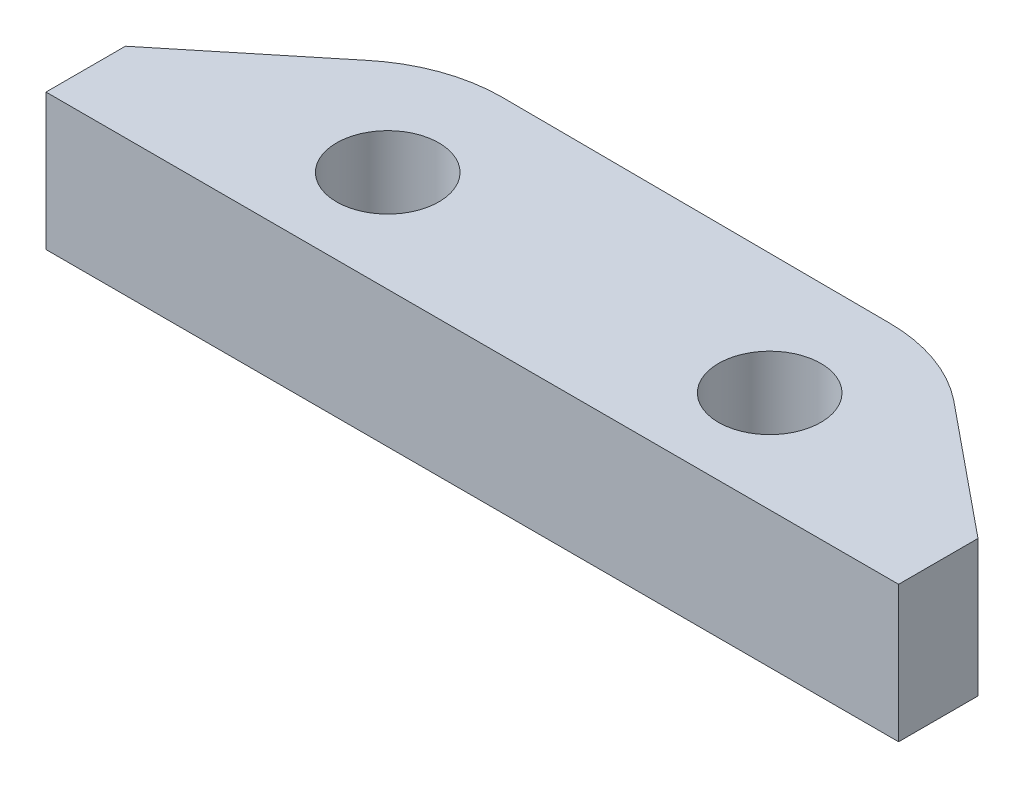
ISO-10303-21;
HEADER;
FILE_DESCRIPTION(('STEP AP214'),'2;1');
FILE_NAME('part.step','',(''),(''),'','','');
FILE_SCHEMA(('AUTOMOTIVE_DESIGN { 1 0 10303 214 1 1 1 1 }'));
ENDSEC;
DATA;
#1=APPLICATION_CONTEXT('core data for automotive mechanical design processes');
#2=APPLICATION_PROTOCOL_DEFINITION('international standard','automotive_design',2000,#1);
#3=PRODUCT_CONTEXT('',#1,'mechanical');
#4=PRODUCT('Part','Part','',(#3));
#5=PRODUCT_RELATED_PRODUCT_CATEGORY('part','',(#4));
#6=PRODUCT_DEFINITION_FORMATION('','',#4);
#7=PRODUCT_DEFINITION_CONTEXT('part definition',#1,'design');
#8=PRODUCT_DEFINITION('design','',#6,#7);
#9=PRODUCT_DEFINITION_SHAPE('','',#8);
#10=(LENGTH_UNIT() NAMED_UNIT(*) SI_UNIT(.MILLI.,.METRE.));
#11=(NAMED_UNIT(*) PLANE_ANGLE_UNIT() SI_UNIT($,.RADIAN.));
#12=(NAMED_UNIT(*) SI_UNIT($,.STERADIAN.) SOLID_ANGLE_UNIT());
#13=UNCERTAINTY_MEASURE_WITH_UNIT(LENGTH_MEASURE(1.E-05),#10,'distance_accuracy_value','');
#14=(GEOMETRIC_REPRESENTATION_CONTEXT(3) GLOBAL_UNCERTAINTY_ASSIGNED_CONTEXT((#13)) GLOBAL_UNIT_ASSIGNED_CONTEXT((#10,
#11,#12)) REPRESENTATION_CONTEXT('',''));
#15=CARTESIAN_POINT('',(0.,0.,0.));
#16=DIRECTION('',(0.,0.,1.));
#17=DIRECTION('',(1.,0.,0.));
#18=AXIS2_PLACEMENT_3D('',#15,#16,#17);
#19=CARTESIAN_POINT('',(-5.68742435642213,4.,1.63906488024816));
#20=DIRECTION('',(0.,1.,0.));
#21=DIRECTION('',(0.,0.,1.));
#22=AXIS2_PLACEMENT_3D('',#19,#20,#21);
#23=PLANE('',#22);
#24=CARTESIAN_POINT('',(-5.44999815077826,4.,0.648590638947355));
#25=DIRECTION('',(0.,1.,0.));
#26=DIRECTION('',(0.,0.,1.));
#27=AXIS2_PLACEMENT_3D('',#24,#25,#26);
#28=CIRCLE('',#27,1.4999999847998);
#29=CARTESIAN_POINT('',(-5.44999815077826,4.,2.14859062374715));
#30=VERTEX_POINT('',#29);
#31=EDGE_CURVE('E146',#30,#30,#28,.T.);
#32=ORIENTED_EDGE('',*,*,#31,.F.);
#33=EDGE_LOOP('',(#32));
#34=FACE_BOUND('',#33,.T.);
#35=DIRECTION('',(-0.774870809072475,0.,0.632119632069253));
#36=VECTOR('',#35,1.);
#37=CARTESIAN_POINT('',(-12.4999979775757,4.,1.29042892201448));
#38=LINE('',#37,#36);
#39=CARTESIAN_POINT('',(-8.6279017925265,4.,-1.86832733408952));
#40=VERTEX_POINT('',#39);
#41=CARTESIAN_POINT('',(-12.4999979775757,4.,1.29042892201448));
#42=VERTEX_POINT('',#41);
#43=EDGE_CURVE('E164',#40,#42,#38,.T.);
#44=ORIENTED_EDGE('',*,*,#43,.T.);
#45=DIRECTION('',(0.,0.,1.));
#46=VECTOR('',#45,1.);
#47=CARTESIAN_POINT('',(-12.4999979775757,4.,1.29042892201448));
#48=LINE('',#47,#46);
#49=CARTESIAN_POINT('',(-12.4999979775757,4.,3.61859063847739));
#50=VERTEX_POINT('',#49);
#51=EDGE_CURVE('E100',#42,#50,#48,.T.);
#52=ORIENTED_EDGE('',*,*,#51,.T.);
#53=DIRECTION('',(1.,0.,0.));
#54=VECTOR('',#53,1.);
#55=CARTESIAN_POINT('',(-12.4999979775757,4.,3.61859063847739));
#56=LINE('',#55,#54);
#57=CARTESIAN_POINT('',(12.5000009536745,4.,3.61859063847739));
#58=VERTEX_POINT('',#57);
#59=EDGE_CURVE('E185',#50,#58,#56,.T.);
#60=ORIENTED_EDGE('',*,*,#59,.T.);
#61=DIRECTION('',(0.,0.,-1.));
#62=VECTOR('',#61,1.);
#63=CARTESIAN_POINT('',(12.5000009536745,4.,3.61859063847739));
#64=LINE('',#63,#62);
#65=CARTESIAN_POINT('',(12.5000009536745,4.,1.29042892201448));
#66=VERTEX_POINT('',#65);
#67=EDGE_CURVE('E199',#58,#66,#64,.T.);
#68=ORIENTED_EDGE('',*,*,#67,.T.);
#69=DIRECTION('',(-0.774870722952468,0.,-0.632119737637673));
#70=VECTOR('',#69,1.);
#71=CARTESIAN_POINT('',(12.5000009536745,4.,1.29042892201448));
#72=LINE('',#71,#70);
#73=CARTESIAN_POINT('',(8.6279058456415,4.,-1.86832733408952));
#74=VERTEX_POINT('',#73);
#75=EDGE_CURVE('E119',#66,#74,#72,.T.);
#76=ORIENTED_EDGE('',*,*,#75,.T.);
#77=CARTESIAN_POINT('',(5.71991749015979,4.,1.79674585860179));
#78=DIRECTION('',(0.,1.,0.));
#79=DIRECTION('',(0.,0.,1.));
#80=AXIS2_PLACEMENT_3D('',#77,#78,#79);
#81=CIRCLE('',#80,4.67858501936233);
#82=CARTESIAN_POINT('',(5.71991749015979,4.,-2.88183916076055));
#83=VERTEX_POINT('',#82);
#84=EDGE_CURVE('E113',#74,#83,#81,.T.);
#85=ORIENTED_EDGE('',*,*,#84,.T.);
#86=DIRECTION('',(-0.999987943106075,0.,-0.00491056437499346));
#87=VECTOR('',#86,1.);
#88=CARTESIAN_POINT('',(5.71991749015979,4.,-2.88183916076054));
#89=LINE('',#88,#87);
#90=CARTESIAN_POINT('',(-5.68742435642213,4.,-2.93785632263872));
#91=VERTEX_POINT('',#90);
#92=EDGE_CURVE('E117',#83,#91,#89,.T.);
#93=ORIENTED_EDGE('',*,*,#92,.T.);
#94=CARTESIAN_POINT('',(-5.68742435642213,4.,1.63906488024816));
#95=DIRECTION('',(0.,1.,0.));
#96=DIRECTION('',(0.,0.,1.));
#97=AXIS2_PLACEMENT_3D('',#94,#95,#96);
#98=CIRCLE('',#97,4.57692120288688);
#99=EDGE_CURVE('E57',#91,#40,#98,.T.);
#100=ORIENTED_EDGE('',*,*,#99,.T.);
#101=EDGE_LOOP('',(#44,#52,#60,#68,#76,#85,#93,#100));
#102=FACE_BOUND('',#101,.T.);
#103=CARTESIAN_POINT('',(5.75000108306335,4.,0.648590609865482));
#104=DIRECTION('',(0.,1.,0.));
#105=DIRECTION('',(0.,0.,1.));
#106=AXIS2_PLACEMENT_3D('',#103,#104,#105);
#107=CIRCLE('',#106,1.49999987061116);
#108=CARTESIAN_POINT('',(5.75000108306335,4.,2.14859048047664));
#109=VERTEX_POINT('',#108);
#110=EDGE_CURVE('E213',#109,#109,#107,.T.);
#111=ORIENTED_EDGE('',*,*,#110,.F.);
#112=EDGE_LOOP('',(#111));
#113=FACE_BOUND('',#112,.T.);
#114=ADVANCED_FACE('F39',(#34,#102,#113),#23,.T.);
#115=CARTESIAN_POINT('',(-5.68742435642213,0.,1.63906488024816));
#116=DIRECTION('',(0.,1.,0.));
#117=DIRECTION('',(0.,0.,1.));
#118=AXIS2_PLACEMENT_3D('',#115,#116,#117);
#119=PLANE('',#118);
#120=DIRECTION('',(-0.774870809072475,0.,0.632119632069253));
#121=VECTOR('',#120,1.);
#122=CARTESIAN_POINT('',(-12.4999979775757,0.,1.29042892201448));
#123=LINE('',#122,#121);
#124=CARTESIAN_POINT('',(-8.6279017925265,0.,-1.86832733408952));
#125=VERTEX_POINT('',#124);
#126=CARTESIAN_POINT('',(-12.4999979775757,0.,1.29042892201448));
#127=VERTEX_POINT('',#126);
#128=EDGE_CURVE('E141',#125,#127,#123,.T.);
#129=ORIENTED_EDGE('',*,*,#128,.F.);
#130=CARTESIAN_POINT('',(-5.68742435642213,0.,1.63906488024816));
#131=DIRECTION('',(0.,1.,0.));
#132=DIRECTION('',(0.,0.,1.));
#133=AXIS2_PLACEMENT_3D('',#130,#131,#132);
#134=CIRCLE('',#133,4.57692120288688);
#135=CARTESIAN_POINT('',(-5.68742435642213,0.,-2.93785632263872));
#136=VERTEX_POINT('',#135);
#137=EDGE_CURVE('E92',#136,#125,#134,.T.);
#138=ORIENTED_EDGE('',*,*,#137,.F.);
#139=DIRECTION('',(-0.999987943106075,0.,-0.00491056437499346));
#140=VECTOR('',#139,1.);
#141=CARTESIAN_POINT('',(5.71991749015979,0.,-2.88183916076054));
#142=LINE('',#141,#140);
#143=CARTESIAN_POINT('',(5.71991749015979,0.,-2.88183916076055));
#144=VERTEX_POINT('',#143);
#145=EDGE_CURVE('E86',#144,#136,#142,.T.);
#146=ORIENTED_EDGE('',*,*,#145,.F.);
#147=CARTESIAN_POINT('',(5.71991749015979,0.,1.79674585860179));
#148=DIRECTION('',(0.,1.,0.));
#149=DIRECTION('',(0.,0.,1.));
#150=AXIS2_PLACEMENT_3D('',#147,#148,#149);
#151=CIRCLE('',#150,4.67858501936233);
#152=CARTESIAN_POINT('',(8.6279058456415,0.,-1.86832733408952));
#153=VERTEX_POINT('',#152);
#154=EDGE_CURVE('E128',#153,#144,#151,.T.);
#155=ORIENTED_EDGE('',*,*,#154,.F.);
#156=DIRECTION('',(-0.774870722952468,0.,-0.632119737637673));
#157=VECTOR('',#156,1.);
#158=CARTESIAN_POINT('',(12.5000009536745,0.,1.29042892201448));
#159=LINE('',#158,#157);
#160=CARTESIAN_POINT('',(12.5000009536745,0.,1.29042892201448));
#161=VERTEX_POINT('',#160);
#162=EDGE_CURVE('E155',#161,#153,#159,.T.);
#163=ORIENTED_EDGE('',*,*,#162,.F.);
#164=DIRECTION('',(0.,0.,-1.));
#165=VECTOR('',#164,1.);
#166=CARTESIAN_POINT('',(12.5000009536745,0.,3.61859063847739));
#167=LINE('',#166,#165);
#168=CARTESIAN_POINT('',(12.5000009536745,0.,3.61859063847739));
#169=VERTEX_POINT('',#168);
#170=EDGE_CURVE('E152',#169,#161,#167,.T.);
#171=ORIENTED_EDGE('',*,*,#170,.F.);
#172=DIRECTION('',(1.,0.,0.));
#173=VECTOR('',#172,1.);
#174=CARTESIAN_POINT('',(-12.4999979775757,0.,3.61859063847739));
#175=LINE('',#174,#173);
#176=CARTESIAN_POINT('',(-12.4999979775757,0.,3.61859063847739));
#177=VERTEX_POINT('',#176);
#178=EDGE_CURVE('E149',#177,#169,#175,.T.);
#179=ORIENTED_EDGE('',*,*,#178,.F.);
#180=DIRECTION('',(0.,0.,1.));
#181=VECTOR('',#180,1.);
#182=CARTESIAN_POINT('',(-12.4999979775757,0.,1.29042892201448));
#183=LINE('',#182,#181);
#184=EDGE_CURVE('E145',#127,#177,#183,.T.);
#185=ORIENTED_EDGE('',*,*,#184,.F.);
#186=EDGE_LOOP('',(#129,#138,#146,#155,#163,#171,#179,#185));
#187=FACE_BOUND('',#186,.T.);
#188=CARTESIAN_POINT('',(-5.44999815077826,0.,0.648590638947355));
#189=DIRECTION('',(0.,1.,0.));
#190=DIRECTION('',(0.,0.,1.));
#191=AXIS2_PLACEMENT_3D('',#188,#189,#190);
#192=CIRCLE('',#191,1.4999999847998);
#193=CARTESIAN_POINT('',(-5.44999815077826,0.,2.14859062374715));
#194=VERTEX_POINT('',#193);
#195=EDGE_CURVE('E209',#194,#194,#192,.T.);
#196=ORIENTED_EDGE('',*,*,#195,.T.);
#197=EDGE_LOOP('',(#196));
#198=FACE_BOUND('',#197,.T.);
#199=CARTESIAN_POINT('',(5.75000108306335,0.,0.648590609865482));
#200=DIRECTION('',(0.,1.,0.));
#201=DIRECTION('',(0.,0.,1.));
#202=AXIS2_PLACEMENT_3D('',#199,#200,#201);
#203=CIRCLE('',#202,1.49999987061116);
#204=CARTESIAN_POINT('',(5.75000108306335,0.,2.14859048047664));
#205=VERTEX_POINT('',#204);
#206=EDGE_CURVE('E217',#205,#205,#203,.T.);
#207=ORIENTED_EDGE('',*,*,#206,.T.);
#208=EDGE_LOOP('',(#207));
#209=FACE_BOUND('',#208,.T.);
#210=ADVANCED_FACE('F189',(#187,#198,#209),#119,.F.);
#211=CARTESIAN_POINT('',(-12.4999979775757,4.,1.29042892201448));
#212=DIRECTION('',(0.632119632069253,0.,0.774870809072475));
#213=DIRECTION('',(0.774870809072475,0.,-0.632119632069253));
#214=AXIS2_PLACEMENT_3D('',#211,#212,#213);
#215=PLANE('',#214);
#216=ORIENTED_EDGE('',*,*,#128,.T.);
#217=DIRECTION('',(0.,-1.,0.));
#218=VECTOR('',#217,1.);
#219=CARTESIAN_POINT('',(-12.4999979775757,4.,1.29042892201448));
#220=LINE('',#219,#218);
#221=EDGE_CURVE('E11',#42,#127,#220,.T.);
#222=ORIENTED_EDGE('',*,*,#221,.F.);
#223=ORIENTED_EDGE('',*,*,#43,.F.);
#224=DIRECTION('',(0.,-1.,0.));
#225=VECTOR('',#224,1.);
#226=CARTESIAN_POINT('',(-8.6279017925265,4.,-1.86832733408952));
#227=LINE('',#226,#225);
#228=EDGE_CURVE('E137',#40,#125,#227,.T.);
#229=ORIENTED_EDGE('',*,*,#228,.T.);
#230=EDGE_LOOP('',(#216,#222,#223,#229));
#231=FACE_BOUND('',#230,.T.);
#232=ADVANCED_FACE('F41',(#231),#215,.F.);
#233=CARTESIAN_POINT('',(-12.4999979775757,4.,1.29042892201448));
#234=DIRECTION('',(1.,0.,0.));
#235=DIRECTION('',(0.,0.,-1.));
#236=AXIS2_PLACEMENT_3D('',#233,#234,#235);
#237=PLANE('',#236);
#238=ORIENTED_EDGE('',*,*,#184,.T.);
#239=DIRECTION('',(0.,-1.,0.));
#240=VECTOR('',#239,1.);
#241=CARTESIAN_POINT('',(-12.4999979775757,4.,3.61859063847739));
#242=LINE('',#241,#240);
#243=EDGE_CURVE('E49',#50,#177,#242,.T.);
#244=ORIENTED_EDGE('',*,*,#243,.F.);
#245=ORIENTED_EDGE('',*,*,#51,.F.);
#246=ORIENTED_EDGE('',*,*,#221,.T.);
#247=EDGE_LOOP('',(#238,#244,#245,#246));
#248=FACE_BOUND('',#247,.T.);
#249=ADVANCED_FACE('F251',(#248),#237,.F.);
#250=CARTESIAN_POINT('',(-12.4999979775757,4.,3.61859063847739));
#251=DIRECTION('',(0.,0.,-1.));
#252=DIRECTION('',(-1.,0.,0.));
#253=AXIS2_PLACEMENT_3D('',#250,#251,#252);
#254=PLANE('',#253);
#255=ORIENTED_EDGE('',*,*,#178,.T.);
#256=DIRECTION('',(0.,-1.,0.));
#257=VECTOR('',#256,1.);
#258=CARTESIAN_POINT('',(12.5000009536745,4.,3.61859063847739));
#259=LINE('',#258,#257);
#260=EDGE_CURVE('E175',#58,#169,#259,.T.);
#261=ORIENTED_EDGE('',*,*,#260,.F.);
#262=ORIENTED_EDGE('',*,*,#59,.F.);
#263=ORIENTED_EDGE('',*,*,#243,.T.);
#264=EDGE_LOOP('',(#255,#261,#262,#263));
#265=FACE_BOUND('',#264,.T.);
#266=ADVANCED_FACE('F183',(#265),#254,.F.);
#267=CARTESIAN_POINT('',(12.5000009536745,4.,3.61859063847739));
#268=DIRECTION('',(-1.,0.,0.));
#269=DIRECTION('',(0.,0.,1.));
#270=AXIS2_PLACEMENT_3D('',#267,#268,#269);
#271=PLANE('',#270);
#272=ORIENTED_EDGE('',*,*,#170,.T.);
#273=DIRECTION('',(0.,-1.,0.));
#274=VECTOR('',#273,1.);
#275=CARTESIAN_POINT('',(12.5000009536745,4.,1.29042892201448));
#276=LINE('',#275,#274);
#277=EDGE_CURVE('E171',#66,#161,#276,.T.);
#278=ORIENTED_EDGE('',*,*,#277,.F.);
#279=ORIENTED_EDGE('',*,*,#67,.F.);
#280=ORIENTED_EDGE('',*,*,#260,.T.);
#281=EDGE_LOOP('',(#272,#278,#279,#280));
#282=FACE_BOUND('',#281,.T.);
#283=ADVANCED_FACE('F194',(#282),#271,.F.);
#284=CARTESIAN_POINT('',(12.5000009536745,4.,1.29042892201448));
#285=DIRECTION('',(-0.632119737637673,0.,0.774870722952468));
#286=DIRECTION('',(0.774870722952468,0.,0.632119737637673));
#287=AXIS2_PLACEMENT_3D('',#284,#285,#286);
#288=PLANE('',#287);
#289=ORIENTED_EDGE('',*,*,#162,.T.);
#290=DIRECTION('',(0.,-1.,0.));
#291=VECTOR('',#290,1.);
#292=CARTESIAN_POINT('',(8.6279058456415,4.,-1.86832733408952));
#293=LINE('',#292,#291);
#294=EDGE_CURVE('E130',#74,#153,#293,.T.);
#295=ORIENTED_EDGE('',*,*,#294,.F.);
#296=ORIENTED_EDGE('',*,*,#75,.F.);
#297=ORIENTED_EDGE('',*,*,#277,.T.);
#298=EDGE_LOOP('',(#289,#295,#296,#297));
#299=FACE_BOUND('',#298,.T.);
#300=ADVANCED_FACE('F197',(#299),#288,.F.);
#301=CARTESIAN_POINT('',(5.71991749015979,4.,1.79674585860179));
#302=DIRECTION('',(0.,-1.,0.));
#303=DIRECTION('',(0.,0.,-1.));
#304=AXIS2_PLACEMENT_3D('',#301,#302,#303);
#305=CYLINDRICAL_SURFACE('',#304,4.67858501936233);
#306=ORIENTED_EDGE('',*,*,#154,.T.);
#307=DIRECTION('',(0.,-1.,0.));
#308=VECTOR('',#307,1.);
#309=CARTESIAN_POINT('',(5.71991749015979,4.,-2.88183916076055));
#310=LINE('',#309,#308);
#311=EDGE_CURVE('E125',#83,#144,#310,.T.);
#312=ORIENTED_EDGE('',*,*,#311,.F.);
#313=ORIENTED_EDGE('',*,*,#84,.F.);
#314=ORIENTED_EDGE('',*,*,#294,.T.);
#315=EDGE_LOOP('',(#306,#312,#313,#314));
#316=FACE_BOUND('',#315,.T.);
#317=ADVANCED_FACE('F126',(#316),#305,.T.);
#318=CARTESIAN_POINT('',(5.71991749015979,4.,-2.88183916076054));
#319=DIRECTION('',(-0.00491056437499346,0.,0.999987943106075));
#320=DIRECTION('',(0.999987943106075,0.,0.00491056437499346));
#321=AXIS2_PLACEMENT_3D('',#318,#319,#320);
#322=PLANE('',#321);
#323=ORIENTED_EDGE('',*,*,#145,.T.);
#324=DIRECTION('',(0.,-1.,0.));
#325=VECTOR('',#324,1.);
#326=CARTESIAN_POINT('',(-5.68742435642213,4.,-2.93785632263872));
#327=LINE('',#326,#325);
#328=EDGE_CURVE('E131',#91,#136,#327,.T.);
#329=ORIENTED_EDGE('',*,*,#328,.F.);
#330=ORIENTED_EDGE('',*,*,#92,.F.);
#331=ORIENTED_EDGE('',*,*,#311,.T.);
#332=EDGE_LOOP('',(#323,#329,#330,#331));
#333=FACE_BOUND('',#332,.T.);
#334=ADVANCED_FACE('F133',(#333),#322,.F.);
#335=CARTESIAN_POINT('',(-5.68742435642213,4.,1.63906488024816));
#336=DIRECTION('',(0.,-1.,0.));
#337=DIRECTION('',(0.,0.,-1.));
#338=AXIS2_PLACEMENT_3D('',#335,#336,#337);
#339=CYLINDRICAL_SURFACE('',#338,4.57692120288688);
#340=ORIENTED_EDGE('',*,*,#137,.T.);
#341=ORIENTED_EDGE('',*,*,#228,.F.);
#342=ORIENTED_EDGE('',*,*,#99,.F.);
#343=ORIENTED_EDGE('',*,*,#328,.T.);
#344=EDGE_LOOP('',(#340,#341,#342,#343));
#345=FACE_BOUND('',#344,.T.);
#346=ADVANCED_FACE('F239',(#345),#339,.T.);
#347=CARTESIAN_POINT('',(-5.44999815077826,4.,0.648590638947355));
#348=DIRECTION('',(0.,-1.,0.));
#349=DIRECTION('',(0.,0.,-1.));
#350=AXIS2_PLACEMENT_3D('',#347,#348,#349);
#351=CYLINDRICAL_SURFACE('',#350,1.4999999847998);
#352=ORIENTED_EDGE('',*,*,#31,.T.);
#353=EDGE_LOOP('',(#352));
#354=FACE_BOUND('',#353,.T.);
#355=ORIENTED_EDGE('',*,*,#195,.F.);
#356=EDGE_LOOP('',(#355));
#357=FACE_BOUND('',#356,.T.);
#358=ADVANCED_FACE('F236',(#354,#357),#351,.F.);
#359=CARTESIAN_POINT('',(5.75000108306335,4.,0.648590609865482));
#360=DIRECTION('',(0.,-1.,0.));
#361=DIRECTION('',(0.,0.,-1.));
#362=AXIS2_PLACEMENT_3D('',#359,#360,#361);
#363=CYLINDRICAL_SURFACE('',#362,1.49999987061116);
#364=ORIENTED_EDGE('',*,*,#110,.T.);
#365=EDGE_LOOP('',(#364));
#366=FACE_BOUND('',#365,.T.);
#367=ORIENTED_EDGE('',*,*,#206,.F.);
#368=EDGE_LOOP('',(#367));
#369=FACE_BOUND('',#368,.T.);
#370=ADVANCED_FACE('F225',(#366,#369),#363,.F.);
#371=CLOSED_SHELL('',(#114,#210,#232,#249,#266,#283,#300,#317,#334,#346,#358,#370));
#372=MANIFOLD_SOLID_BREP('B2',#371);
#373=ADVANCED_BREP_SHAPE_REPRESENTATION('',(#18,#372),#14);
#374=SHAPE_DEFINITION_REPRESENTATION(#9,#373);
ENDSEC;
END-ISO-10303-21;
